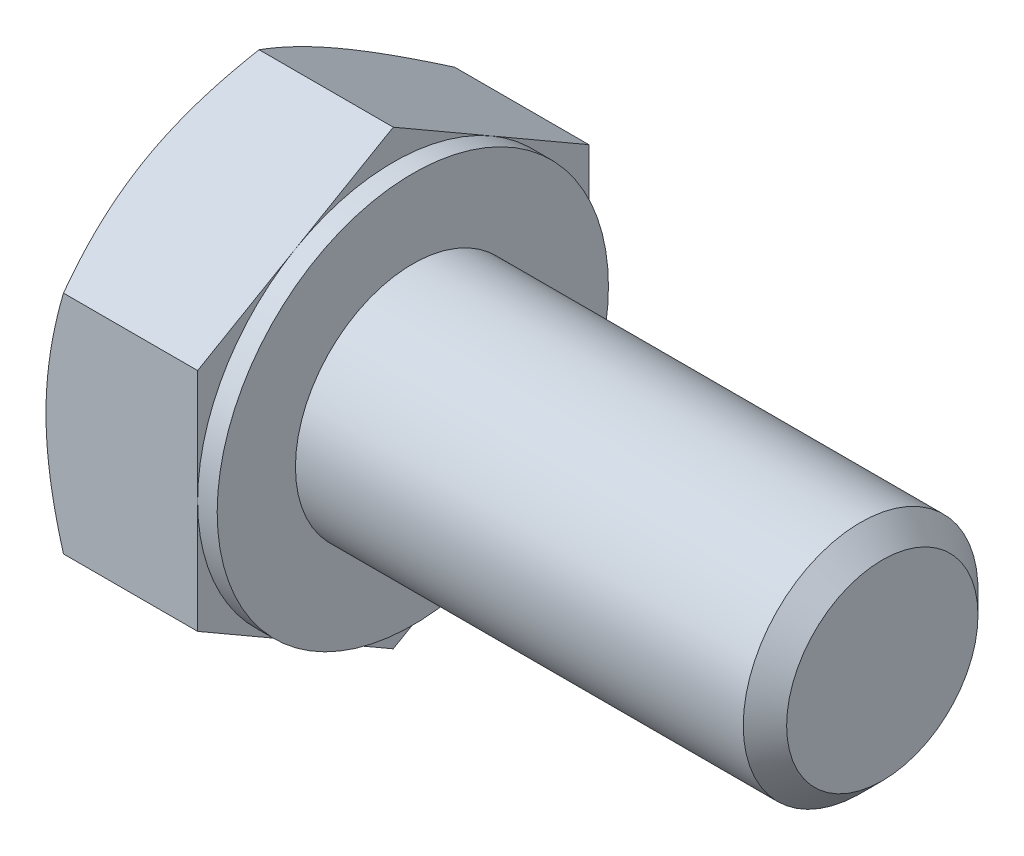
ISO-10303-21;
HEADER;
FILE_DESCRIPTION(('STEP AP214'),'2;1');
FILE_NAME('part.step','',(''),(''),'','','');
FILE_SCHEMA(('AUTOMOTIVE_DESIGN { 1 0 10303 214 1 1 1 1 }'));
ENDSEC;
DATA;
#1=APPLICATION_CONTEXT('core data for automotive mechanical design processes');
#2=APPLICATION_PROTOCOL_DEFINITION('international standard','automotive_design',2000,#1);
#3=PRODUCT_CONTEXT('',#1,'mechanical');
#4=PRODUCT('Part','Part','',(#3));
#5=PRODUCT_RELATED_PRODUCT_CATEGORY('part','',(#4));
#6=PRODUCT_DEFINITION_FORMATION('','',#4);
#7=PRODUCT_DEFINITION_CONTEXT('part definition',#1,'design');
#8=PRODUCT_DEFINITION('design','',#6,#7);
#9=PRODUCT_DEFINITION_SHAPE('','',#8);
#10=(LENGTH_UNIT() NAMED_UNIT(*) SI_UNIT(.MILLI.,.METRE.));
#11=(NAMED_UNIT(*) PLANE_ANGLE_UNIT() SI_UNIT($,.RADIAN.));
#12=(NAMED_UNIT(*) SI_UNIT($,.STERADIAN.) SOLID_ANGLE_UNIT());
#13=UNCERTAINTY_MEASURE_WITH_UNIT(LENGTH_MEASURE(1.E-05),#10,'distance_accuracy_value','');
#14=(GEOMETRIC_REPRESENTATION_CONTEXT(3) GLOBAL_UNCERTAINTY_ASSIGNED_CONTEXT((#13)) GLOBAL_UNIT_ASSIGNED_CONTEXT((#10,
#11,#12)) REPRESENTATION_CONTEXT('',''));
#15=CARTESIAN_POINT('',(0.,0.,0.));
#16=DIRECTION('',(0.,0.,1.));
#17=DIRECTION('',(1.,0.,0.));
#18=AXIS2_PLACEMENT_3D('',#15,#16,#17);
#19=CARTESIAN_POINT('',(4.375,5.77350269189626,0.));
#20=DIRECTION('',(1.,0.,0.));
#21=DIRECTION('',(0.,0.,-1.));
#22=AXIS2_PLACEMENT_3D('',#19,#20,#21);
#23=PLANE('',#22);
#24=CARTESIAN_POINT('',(4.375,0.,0.));
#25=DIRECTION('',(1.,0.,0.));
#26=DIRECTION('',(0.,0.,-1.));
#27=AXIS2_PLACEMENT_3D('',#24,#25,#26);
#28=CIRCLE('',#27,3.);
#29=CARTESIAN_POINT('',(4.375,0.,-3.));
#30=VERTEX_POINT('',#29);
#31=EDGE_CURVE('E287',#30,#30,#28,.F.);
#32=ORIENTED_EDGE('',*,*,#31,.T.);
#33=EDGE_LOOP('',(#32));
#34=FACE_BOUND('',#33,.T.);
#35=CARTESIAN_POINT('',(4.375,0.,0.));
#36=DIRECTION('',(1.,0.,0.));
#37=DIRECTION('',(0.,0.,-1.));
#38=AXIS2_PLACEMENT_3D('',#35,#36,#37);
#39=CIRCLE('',#38,5.);
#40=CARTESIAN_POINT('',(4.375,0.,-5.));
#41=VERTEX_POINT('',#40);
#42=EDGE_CURVE('E306',#41,#41,#39,.T.);
#43=ORIENTED_EDGE('',*,*,#42,.T.);
#44=EDGE_LOOP('',(#43));
#45=FACE_BOUND('',#44,.T.);
#46=ADVANCED_FACE('F41',(#34,#45),#23,.T.);
#47=CARTESIAN_POINT('',(0.,0.,0.));
#48=DIRECTION('',(-1.,0.,0.));
#49=DIRECTION('',(0.,0.,1.));
#50=AXIS2_PLACEMENT_3D('',#47,#48,#49);
#51=CYLINDRICAL_SURFACE('',#50,3.);
#52=ORIENTED_EDGE('',*,*,#31,.F.);
#53=EDGE_LOOP('',(#52));
#54=FACE_BOUND('',#53,.T.);
#55=CARTESIAN_POINT('',(15.8205,0.,0.));
#56=DIRECTION('',(-1.,0.,0.));
#57=DIRECTION('',(0.,0.,1.));
#58=AXIS2_PLACEMENT_3D('',#55,#56,#57);
#59=CIRCLE('',#58,3.);
#60=CARTESIAN_POINT('',(15.8205,0.,3.));
#61=VERTEX_POINT('',#60);
#62=EDGE_CURVE('E284',#61,#61,#59,.T.);
#63=ORIENTED_EDGE('',*,*,#62,.T.);
#64=EDGE_LOOP('',(#63));
#65=FACE_BOUND('',#64,.T.);
#66=ADVANCED_FACE('F256',(#54,#65),#51,.T.);
#67=CARTESIAN_POINT('',(16.375,0.,0.));
#68=DIRECTION('',(-1.,0.,0.));
#69=DIRECTION('',(0.,0.,1.));
#70=AXIS2_PLACEMENT_3D('',#67,#68,#69);
#71=CONICAL_SURFACE('',#70,2.4455,0.785398163397442);
#72=ORIENTED_EDGE('',*,*,#62,.F.);
#73=EDGE_LOOP('',(#72));
#74=FACE_BOUND('',#73,.T.);
#75=CARTESIAN_POINT('',(16.375,0.,0.));
#76=DIRECTION('',(-1.,0.,0.));
#77=DIRECTION('',(0.,0.,1.));
#78=AXIS2_PLACEMENT_3D('',#75,#76,#77);
#79=CIRCLE('',#78,2.4455);
#80=CARTESIAN_POINT('',(16.375,0.,2.4455));
#81=VERTEX_POINT('',#80);
#82=EDGE_CURVE('E282',#81,#81,#79,.T.);
#83=ORIENTED_EDGE('',*,*,#82,.T.);
#84=EDGE_LOOP('',(#83));
#85=FACE_BOUND('',#84,.T.);
#86=ADVANCED_FACE('F263',(#74,#85),#71,.T.);
#87=CARTESIAN_POINT('',(16.375,0.,0.));
#88=DIRECTION('',(-1.,0.,0.));
#89=DIRECTION('',(0.,0.,1.));
#90=AXIS2_PLACEMENT_3D('',#87,#88,#89);
#91=PLANE('',#90);
#92=ORIENTED_EDGE('',*,*,#82,.F.);
#93=EDGE_LOOP('',(#92));
#94=FACE_BOUND('',#93,.T.);
#95=ADVANCED_FACE('F270',(#94),#91,.F.);
#96=CARTESIAN_POINT('',(3.875,5.,0.));
#97=DIRECTION('',(1.,0.,0.));
#98=DIRECTION('',(0.,0.,-1.));
#99=AXIS2_PLACEMENT_3D('',#96,#97,#98);
#100=PLANE('',#99);
#101=DIRECTION('',(0.,0.500000000000001,0.866025403784438));
#102=VECTOR('',#101,1.);
#103=CARTESIAN_POINT('',(3.875,2.88675134594812,-5.));
#104=LINE('',#103,#102);
#105=CARTESIAN_POINT('',(3.875,2.88675134594812,-5.));
#106=VERTEX_POINT('',#105);
#107=CARTESIAN_POINT('',(3.875,4.33012701892219,-2.50000000000001));
#108=VERTEX_POINT('',#107);
#109=EDGE_CURVE('E174',#106,#108,#104,.T.);
#110=ORIENTED_EDGE('',*,*,#109,.T.);
#111=CARTESIAN_POINT('',(3.875,0.,0.));
#112=DIRECTION('',(-1.,0.,0.));
#113=DIRECTION('',(0.,0.,1.));
#114=AXIS2_PLACEMENT_3D('',#111,#112,#113);
#115=CIRCLE('',#114,5.);
#116=CARTESIAN_POINT('',(3.875,0.,-5.));
#117=VERTEX_POINT('',#116);
#118=EDGE_CURVE('E57',#108,#117,#115,.T.);
#119=ORIENTED_EDGE('',*,*,#118,.T.);
#120=DIRECTION('',(0.,1.,0.));
#121=VECTOR('',#120,1.);
#122=CARTESIAN_POINT('',(3.875,2.88675134594812,-5.));
#123=LINE('',#122,#121);
#124=EDGE_CURVE('E46',#117,#106,#123,.T.);
#125=ORIENTED_EDGE('',*,*,#124,.T.);
#126=EDGE_LOOP('',(#110,#119,#125));
#127=FACE_BOUND('',#126,.T.);
#128=ADVANCED_FACE('F273',(#127),#100,.T.);
#129=CARTESIAN_POINT('',(3.875,5.77350269189626,0.));
#130=VERTEX_POINT('',#129);
#131=EDGE_CURVE('E172',#108,#130,#104,.T.);
#132=ORIENTED_EDGE('',*,*,#131,.T.);
#133=DIRECTION('',(0.,-0.500000000000001,0.866025403784438));
#134=VECTOR('',#133,1.);
#135=CARTESIAN_POINT('',(3.875,5.77350269189626,0.));
#136=LINE('',#135,#134);
#137=CARTESIAN_POINT('',(3.875,4.33012701892219,2.50000000000001));
#138=VERTEX_POINT('',#137);
#139=EDGE_CURVE('E171',#130,#138,#136,.T.);
#140=ORIENTED_EDGE('',*,*,#139,.T.);
#141=EDGE_CURVE('E160',#138,#108,#115,.T.);
#142=ORIENTED_EDGE('',*,*,#141,.T.);
#143=EDGE_LOOP('',(#132,#140,#142));
#144=FACE_BOUND('',#143,.T.);
#145=ADVANCED_FACE('F278',(#144),#100,.T.);
#146=CARTESIAN_POINT('',(3.875,2.88675134594813,5.));
#147=VERTEX_POINT('',#146);
#148=EDGE_CURVE('E139',#138,#147,#136,.T.);
#149=ORIENTED_EDGE('',*,*,#148,.T.);
#150=DIRECTION('',(0.,-1.,0.));
#151=VECTOR('',#150,1.);
#152=CARTESIAN_POINT('',(3.875,2.88675134594813,5.));
#153=LINE('',#152,#151);
#154=CARTESIAN_POINT('',(3.875,0.,5.));
#155=VERTEX_POINT('',#154);
#156=EDGE_CURVE('E133',#147,#155,#153,.T.);
#157=ORIENTED_EDGE('',*,*,#156,.T.);
#158=EDGE_CURVE('E137',#155,#138,#115,.T.);
#159=ORIENTED_EDGE('',*,*,#158,.T.);
#160=EDGE_LOOP('',(#149,#157,#159));
#161=FACE_BOUND('',#160,.T.);
#162=ADVANCED_FACE('F135',(#161),#100,.T.);
#163=CARTESIAN_POINT('',(3.875,-2.88675134594813,5.));
#164=VERTEX_POINT('',#163);
#165=EDGE_CURVE('E143',#155,#164,#153,.T.);
#166=ORIENTED_EDGE('',*,*,#165,.T.);
#167=DIRECTION('',(0.,-0.500000000000001,-0.866025403784438));
#168=VECTOR('',#167,1.);
#169=CARTESIAN_POINT('',(3.875,-5.77350269189627,0.));
#170=LINE('',#169,#168);
#171=CARTESIAN_POINT('',(3.875,-4.33012701892219,2.50000000000001));
#172=VERTEX_POINT('',#171);
#173=EDGE_CURVE('E150',#164,#172,#170,.T.);
#174=ORIENTED_EDGE('',*,*,#173,.T.);
#175=EDGE_CURVE('E147',#172,#155,#115,.T.);
#176=ORIENTED_EDGE('',*,*,#175,.T.);
#177=EDGE_LOOP('',(#166,#174,#176));
#178=FACE_BOUND('',#177,.T.);
#179=ADVANCED_FACE('F148',(#178),#100,.T.);
#180=CARTESIAN_POINT('',(3.875,-5.77350269189627,0.));
#181=VERTEX_POINT('',#180);
#182=EDGE_CURVE('E166',#172,#181,#170,.T.);
#183=ORIENTED_EDGE('',*,*,#182,.T.);
#184=DIRECTION('',(0.,0.500000000000001,-0.866025403784438));
#185=VECTOR('',#184,1.);
#186=CARTESIAN_POINT('',(3.875,-2.88675134594814,-5.));
#187=LINE('',#186,#185);
#188=CARTESIAN_POINT('',(3.875,-4.33012701892219,-2.5));
#189=VERTEX_POINT('',#188);
#190=EDGE_CURVE('E342',#181,#189,#187,.T.);
#191=ORIENTED_EDGE('',*,*,#190,.T.);
#192=EDGE_CURVE('E154',#189,#172,#115,.T.);
#193=ORIENTED_EDGE('',*,*,#192,.T.);
#194=EDGE_LOOP('',(#183,#191,#193));
#195=FACE_BOUND('',#194,.T.);
#196=ADVANCED_FACE('F347',(#195),#100,.T.);
#197=CARTESIAN_POINT('',(3.875,-2.88675134594814,-5.));
#198=VERTEX_POINT('',#197);
#199=EDGE_CURVE('E161',#189,#198,#187,.T.);
#200=ORIENTED_EDGE('',*,*,#199,.T.);
#201=EDGE_CURVE('E11',#198,#117,#123,.T.);
#202=ORIENTED_EDGE('',*,*,#201,.T.);
#203=EDGE_CURVE('E360',#117,#189,#115,.T.);
#204=ORIENTED_EDGE('',*,*,#203,.T.);
#205=EDGE_LOOP('',(#200,#202,#204));
#206=FACE_BOUND('',#205,.T.);
#207=ADVANCED_FACE('F279',(#206),#100,.T.);
#208=CARTESIAN_POINT('',(0.,0.,0.));
#209=DIRECTION('',(-1.,0.,0.));
#210=DIRECTION('',(0.,0.,1.));
#211=AXIS2_PLACEMENT_3D('',#208,#209,#210);
#212=CYLINDRICAL_SURFACE('',#211,5.);
#213=ORIENTED_EDGE('',*,*,#118,.F.);
#214=ORIENTED_EDGE('',*,*,#141,.F.);
#215=ORIENTED_EDGE('',*,*,#158,.F.);
#216=ORIENTED_EDGE('',*,*,#175,.F.);
#217=ORIENTED_EDGE('',*,*,#192,.F.);
#218=ORIENTED_EDGE('',*,*,#203,.F.);
#219=EDGE_LOOP('',(#213,#214,#215,#216,#217,#218));
#220=FACE_BOUND('',#219,.T.);
#221=ORIENTED_EDGE('',*,*,#42,.F.);
#222=EDGE_LOOP('',(#221));
#223=FACE_BOUND('',#222,.T.);
#224=ADVANCED_FACE('F157',(#220,#223),#212,.T.);
#225=CARTESIAN_POINT('',(0.,5.77350269189626,0.));
#226=DIRECTION('',(1.,0.,0.));
#227=DIRECTION('',(0.,0.,-1.));
#228=AXIS2_PLACEMENT_3D('',#225,#226,#227);
#229=PLANE('',#228);
#230=CARTESIAN_POINT('',(0.,0.,0.));
#231=DIRECTION('',(1.,0.,0.));
#232=DIRECTION('',(0.,0.,-1.));
#233=AXIS2_PLACEMENT_3D('',#230,#231,#232);
#234=CIRCLE('',#233,5.);
#235=CARTESIAN_POINT('',(0.,0.,-5.));
#236=VERTEX_POINT('',#235);
#237=CARTESIAN_POINT('',(0.,4.33012701892219,-2.50000000000001));
#238=VERTEX_POINT('',#237);
#239=EDGE_CURVE('E305',#236,#238,#234,.T.);
#240=ORIENTED_EDGE('',*,*,#239,.F.);
#241=CARTESIAN_POINT('',(0.,-4.33012701892219,-2.5));
#242=VERTEX_POINT('',#241);
#243=EDGE_CURVE('E302',#242,#236,#234,.T.);
#244=ORIENTED_EDGE('',*,*,#243,.F.);
#245=CARTESIAN_POINT('',(0.,-4.33012701892219,2.50000000000001));
#246=VERTEX_POINT('',#245);
#247=EDGE_CURVE('E304',#246,#242,#234,.T.);
#248=ORIENTED_EDGE('',*,*,#247,.F.);
#249=CARTESIAN_POINT('',(0.,0.,5.));
#250=VERTEX_POINT('',#249);
#251=EDGE_CURVE('E314',#250,#246,#234,.T.);
#252=ORIENTED_EDGE('',*,*,#251,.F.);
#253=CARTESIAN_POINT('',(0.,0.,0.));
#254=DIRECTION('',(-1.,0.,0.));
#255=DIRECTION('',(0.,0.,1.));
#256=AXIS2_PLACEMENT_3D('',#253,#254,#255);
#257=CIRCLE('',#256,5.);
#258=CARTESIAN_POINT('',(0.,4.33012701892219,2.50000000000001));
#259=VERTEX_POINT('',#258);
#260=EDGE_CURVE('E175',#250,#259,#257,.T.);
#261=ORIENTED_EDGE('',*,*,#260,.T.);
#262=EDGE_CURVE('E309',#238,#259,#234,.T.);
#263=ORIENTED_EDGE('',*,*,#262,.F.);
#264=EDGE_LOOP('',(#240,#244,#248,#252,#261,#263));
#265=FACE_BOUND('',#264,.T.);
#266=ADVANCED_FACE('F206',(#265),#229,.F.);
#267=CARTESIAN_POINT('',(0.,0.,0.));
#268=DIRECTION('',(1.,0.,0.));
#269=DIRECTION('',(0.,0.,-1.));
#270=AXIS2_PLACEMENT_3D('',#267,#268,#269);
#271=CONICAL_SURFACE('',#270,5.,1.0471975511966);
#272=CARTESIAN_POINT('',(0.446648656051827,2.88663587589429,5.0002));
#273=CARTESIAN_POINT('',(0.373386567637633,3.01349970319368,4.78046540547481));
#274=CARTESIAN_POINT('',(0.30675132191809,3.14144859993849,4.55885141554042));
#275=CARTESIAN_POINT('',(0.19043899101081,3.39956193532121,4.11178600454649));
#276=CARTESIAN_POINT('',(0.140803049915788,3.52973095989717,3.88632664040923));
#277=CARTESIAN_POINT('',(0.0635510254186973,3.78847564779797,3.43816769477649));
#278=CARTESIAN_POINT('',(0.035420378283489,3.91701101576052,3.21553790689581));
#279=CARTESIAN_POINT('',(0.0101949219536844,4.11026620624322,2.88081009815336));
#280=CARTESIAN_POINT('',(0.00461345976948404,4.17472868879311,2.76915780319494));
#281=CARTESIAN_POINT('',(-0.000797783248529712,4.30371322717528,2.5457500293262));
#282=CARTESIAN_POINT('',(-0.00062774174179669,4.36823528110589,2.43399455370969));
#283=CARTESIAN_POINT('',(0.00775363179203661,4.54500768479194,2.12781576914936));
#284=CARTESIAN_POINT('',(0.0218297718972524,4.65719946015293,1.93349391403279));
#285=CARTESIAN_POINT('',(0.0664652571094322,4.88083840557981,1.54613989800229));
#286=CARTESIAN_POINT('',(0.0970398601475092,4.9922847895602,1.35310909862843));
#287=CARTESIAN_POINT('',(0.173468493621165,5.21637431361295,0.964974657525145));
#288=CARTESIAN_POINT('',(0.219646378878681,5.32898917185759,0.769920001358264));
#289=CARTESIAN_POINT('',(0.324451794491936,5.55253939626498,0.382719654641231));
#290=CARTESIAN_POINT('',(0.383054703437376,5.66347762579592,0.190569004591913));
#291=CARTESIAN_POINT('',(0.446648656051831,5.7736181619501,-0.000200000000000752));
#292=B_SPLINE_CURVE_WITH_KNOTS('',3,(#272,#273,#274,#275,#276,#277,#278,#279,#280,#281,#282,
#283,#284,#285,#286,#287,#288,#289,#290,#291),.UNSPECIFIED.,.F.,.F.,(4,2,2,2,2,2,2,2,2,4),(0.,
0.792555841363091,1.58701660053333,2.3618153748728,2.74884076077325,3.13585419177295,
3.80962362599679,4.48401723901189,5.17336882348929,5.86136694793726),.UNSPECIFIED.);
#293=CARTESIAN_POINT('',(0.446581987385204,5.77350269189626,0.));
#294=VERTEX_POINT('',#293);
#295=EDGE_CURVE('E225',#259,#294,#292,.T.);
#296=ORIENTED_EDGE('',*,*,#295,.T.);
#297=CARTESIAN_POINT('',(0.44664865605183,5.7736181619501,0.0002));
#298=CARTESIAN_POINT('',(0.373386567637636,5.64675433465071,-0.219534594525185));
#299=CARTESIAN_POINT('',(0.306751321918093,5.5188054379059,-0.44114858445958));
#300=CARTESIAN_POINT('',(0.190438991010812,5.26069210252318,-0.888213995453513));
#301=CARTESIAN_POINT('',(0.14080304991579,5.13052307794721,-1.11367335959077));
#302=CARTESIAN_POINT('',(0.0635510254186989,4.87177839004641,-1.56183230522351));
#303=CARTESIAN_POINT('',(0.0354203782834904,4.74324302208387,-1.78446209310419));
#304=CARTESIAN_POINT('',(0.0101949219536849,4.54998783160116,-2.11918990184664));
#305=CARTESIAN_POINT('',(0.00461345976948399,4.48552534905128,-2.23084219680506));
#306=CARTESIAN_POINT('',(-0.00079778324852991,4.35654081066911,-2.4542499706738));
#307=CARTESIAN_POINT('',(-0.000627741741796554,4.2920187567385,-2.56600544629031));
#308=CARTESIAN_POINT('',(0.00775363179203672,4.11524635305244,-2.87218423085064));
#309=CARTESIAN_POINT('',(0.0218297718972514,4.00305457769146,-3.06650608596721));
#310=CARTESIAN_POINT('',(0.0664652571094302,3.77941563226457,-3.4538601019977));
#311=CARTESIAN_POINT('',(0.0970398601475074,3.66796924828418,-3.64689090137157));
#312=CARTESIAN_POINT('',(0.173468493621163,3.44387972423144,-4.03502534247485));
#313=CARTESIAN_POINT('',(0.219646378878679,3.3312648659868,-4.23007999864173));
#314=CARTESIAN_POINT('',(0.324451794491932,3.1077146415794,-4.61728034535877));
#315=CARTESIAN_POINT('',(0.383054703437372,2.99677641204847,-4.80943099540809));
#316=CARTESIAN_POINT('',(0.446648656051827,2.88663587589429,-5.0002));
#317=B_SPLINE_CURVE_WITH_KNOTS('',3,(#297,#298,#299,#300,#301,#302,#303,#304,#305,#306,#307,
#308,#309,#310,#311,#312,#313,#314,#315,#316),.UNSPECIFIED.,.F.,.F.,(4,2,2,2,2,2,2,2,2,4),(0.,
0.79255584136309,1.58701660053334,2.36181537487281,2.74884076077326,3.13585419177295,
3.80962362599679,4.48401723901189,5.17336882348929,5.86136694793726),.UNSPECIFIED.);
#318=EDGE_CURVE('E65',#294,#238,#317,.T.);
#319=ORIENTED_EDGE('',*,*,#318,.T.);
#320=ORIENTED_EDGE('',*,*,#262,.T.);
#321=EDGE_LOOP('',(#296,#319,#320));
#322=FACE_BOUND('',#321,.T.);
#323=ADVANCED_FACE('F356',(#322),#271,.T.);
#324=CARTESIAN_POINT('',(2.47533544689296,-7.82661640313891,5.));
#325=CARTESIAN_POINT('',(2.36879683507773,-7.60758613024923,5.));
#326=CARTESIAN_POINT('',(2.26325911833056,-7.38806071364412,5.));
#327=CARTESIAN_POINT('',(2.05474707865951,-6.94775649535434,5.));
#328=CARTESIAN_POINT('',(1.95177314617003,-6.72697750897689,5.));
#329=CARTESIAN_POINT('',(1.74844778545275,-6.28280027125598,5.));
#330=CARTESIAN_POINT('',(1.64811306490869,-6.05939434592714,5.));
#331=CARTESIAN_POINT('',(1.45145486004312,-5.61083043832921,5.));
#332=CARTESIAN_POINT('',(1.35513119080617,-5.38567253739806,5.));
#333=CARTESIAN_POINT('',(1.16445037605961,-4.92576614780204,5.));
#334=CARTESIAN_POINT('',(1.07026351405996,-4.69094667859486,5.));
#335=CARTESIAN_POINT('',(0.88884438735084,-4.21858752735363,5.));
#336=CARTESIAN_POINT('',(0.801612892640662,-3.98104754746318,5.));
#337=CARTESIAN_POINT('',(0.636341071883242,-3.50329086404364,5.));
#338=CARTESIAN_POINT('',(0.558282765149713,-3.26308044250488,5.));
#339=CARTESIAN_POINT('',(0.413813856737667,-2.77921467819532,5.));
#340=CARTESIAN_POINT('',(0.347399663631977,-2.53556042276,5.));
#341=CARTESIAN_POINT('',(0.229707450535053,-2.04600448312504,5.));
#342=CARTESIAN_POINT('',(0.17834657344248,-1.80012308686184,5.));
#343=CARTESIAN_POINT('',(0.0936230804935156,-1.30522837494366,5.));
#344=CARTESIAN_POINT('',(0.0602585789244929,-1.05621539022478,5.));
#345=CARTESIAN_POINT('',(0.0146229933804848,-0.559584253783076,5.));
#346=CARTESIAN_POINT('',(0.0020749850658413,-0.311992192967683,5.));
#347=CARTESIAN_POINT('',(-0.00159747165030544,0.18337558405673,5.));
#348=CARTESIAN_POINT('',(0.00727849448086171,0.431151303726633,5.));
#349=CARTESIAN_POINT('',(0.0397265053205832,0.849622860758219,5.));
#350=CARTESIAN_POINT('',(0.0579847912618786,1.02075746544155,5.));
#351=CARTESIAN_POINT('',(0.103624049996721,1.36181398757519,5.));
#352=CARTESIAN_POINT('',(0.131006199082923,1.5317357457727,5.));
#353=CARTESIAN_POINT('',(0.22540333381632,2.03942834541586,5.));
#354=CARTESIAN_POINT('',(0.304653621104034,2.37495177168562,5.));
#355=CARTESIAN_POINT('',(0.442611792168637,2.87686006020151,5.));
#356=CARTESIAN_POINT('',(0.492453035928114,3.04583048582564,5.));
#357=CARTESIAN_POINT('',(0.597441969480138,3.38213061038658,5.));
#358=CARTESIAN_POINT('',(0.652589698776803,3.54946029709868,5.));
#359=CARTESIAN_POINT('',(0.767295730006394,3.88253122341816,5.));
#360=CARTESIAN_POINT('',(0.826852713137812,4.04827292137364,5.));
#361=CARTESIAN_POINT('',(0.949663499110048,4.37837269604182,5.));
#362=CARTESIAN_POINT('',(1.01291722636637,4.54273080096525,5.));
#363=CARTESIAN_POINT('',(1.18384085306905,4.97467594039768,5.));
#364=CARTESIAN_POINT('',(1.29410564783453,5.24123504256647,5.));
#365=CARTESIAN_POINT('',(1.52085041203992,5.77170603526333,5.));
#366=CARTESIAN_POINT('',(1.63733099805396,6.03561766007927,5.));
#367=CARTESIAN_POINT('',(1.87507624393348,6.56138078778337,5.));
#368=CARTESIAN_POINT('',(1.99634255328237,6.82323154239328,5.));
#369=CARTESIAN_POINT('',(2.24254703861692,7.34518395602015,5.));
#370=CARTESIAN_POINT('',(2.36748508200601,7.60528567778374,5.));
#371=CARTESIAN_POINT('',(2.62044102887897,8.12446478659921,5.));
#372=CARTESIAN_POINT('',(2.74846325062125,8.38354006552432,5.));
#373=CARTESIAN_POINT('',(3.00682668967549,8.9005329112754,5.));
#374=CARTESIAN_POINT('',(3.13716793074432,9.15845046620728,5.));
#375=CARTESIAN_POINT('',(3.53092424591316,9.93067662274979,5.));
#376=CARTESIAN_POINT('',(3.79712405172275,10.4435647238032,5.));
#377=CARTESIAN_POINT('',(4.3072404688117,11.4147548711532,5.));
#378=CARTESIAN_POINT('',(4.55067498762245,11.873311348306,5.));
#379=CARTESIAN_POINT('',(5.04052915785298,12.7888590468283,5.));
#380=CARTESIAN_POINT('',(5.28694897482743,13.2458501795696,5.));
#381=CARTESIAN_POINT('',(5.7812250534644,14.1571829390174,5.));
#382=CARTESIAN_POINT('',(6.02907430461245,14.6115283739736,5.));
#383=CARTESIAN_POINT('',(6.52648185519851,15.5192398746589,5.));
#384=CARTESIAN_POINT('',(6.77604002809907,15.9726060096992,5.));
#385=CARTESIAN_POINT('',(7.02622264559118,16.4256251044156,5.));
#386=B_SPLINE_CURVE_WITH_KNOTS('',3,(#324,#325,#326,#327,#328,#329,#330,#331,#332,#333,#334,
#335,#336,#337,#338,#339,#340,#341,#342,#343,#344,#345,#346,#347,#348,#349,#350,#351,#352,#353,
#354,#355,#356,#357,#358,#359,#360,#361,#362,#363,#364,#365,#366,#367,#368,#369,#370,#371,#372,
#373,#374,#375,#376,#377,#378,#379,#380,#381,#382,#383,#384,#385),.UNSPECIFIED.,.F.,.F.,(4,2,2,
2,2,2,2,2,2,2,2,2,2,2,2,2,2,2,2,2,2,2,2,2,2,2,2,2,2,2,4),(0.,0.730708682143099,1.46152797033751,
2.19620403652929,2.930846195478,3.68977491658213,4.44878753915767,5.20628666210828,
5.9635517348485,6.71656679485872,7.46950293642268,8.212339912373,8.95519126159774,
9.4712599123247,9.98739512288343,11.0201893937443,11.5486465414698,12.0771076235976,
12.6054112774226,13.1337041332035,13.9989833719716,14.8643486020619,15.7300147459346,
16.5956496665091,17.4625765068272,18.3295122333794,20.0630293163822,21.6205191219182,
23.1780956996636,24.7307447704824,26.2832800921359),.UNSPECIFIED.);
#387=CARTESIAN_POINT('',(0.446581987385201,2.88675134594812,5.));
#388=VERTEX_POINT('',#387);
#389=EDGE_CURVE('E239',#250,#388,#386,.T.);
#390=ORIENTED_EDGE('',*,*,#389,.T.);
#391=EDGE_CURVE('E238',#388,#259,#292,.T.);
#392=ORIENTED_EDGE('',*,*,#391,.T.);
#393=ORIENTED_EDGE('',*,*,#260,.F.);
#394=EDGE_LOOP('',(#390,#392,#393));
#395=FACE_BOUND('',#394,.T.);
#396=ADVANCED_FACE('F352',(#395),#271,.T.);
#397=CARTESIAN_POINT('',(0.446581987385203,-2.88675134594813,5.));
#398=VERTEX_POINT('',#397);
#399=EDGE_CURVE('E285',#398,#250,#386,.T.);
#400=ORIENTED_EDGE('',*,*,#399,.T.);
#401=ORIENTED_EDGE('',*,*,#251,.T.);
#402=CARTESIAN_POINT('',(0.446648656051836,-5.77361816195011,-0.000200000000000037));
#403=CARTESIAN_POINT('',(0.373386567637641,-5.64675433465072,0.219534594525185));
#404=CARTESIAN_POINT('',(0.306751321918098,-5.51880543790591,0.441148584459581));
#405=CARTESIAN_POINT('',(0.190438991010817,-5.26069210252319,0.888213995453515));
#406=CARTESIAN_POINT('',(0.140803049915796,-5.13052307794722,1.11367335959078));
#407=CARTESIAN_POINT('',(0.0635510254187038,-4.87177839004642,1.56183230522351));
#408=CARTESIAN_POINT('',(0.0354203782834944,-4.74324302208388,1.7844620931042));
#409=CARTESIAN_POINT('',(0.0101949219536894,-4.54998783160117,2.11918990184664));
#410=CARTESIAN_POINT('',(0.00461345976948905,-4.48552534905129,2.23084219680506));
#411=CARTESIAN_POINT('',(-0.000797783248524703,-4.35654081066912,2.4542499706738));
#412=CARTESIAN_POINT('',(-0.000627741741791686,-4.29201875673851,2.56600544629032));
#413=CARTESIAN_POINT('',(0.00775363179204125,-4.11524635305245,2.87218423085064));
#414=CARTESIAN_POINT('',(0.0218297718972562,-4.00305457769147,3.06650608596722));
#415=CARTESIAN_POINT('',(0.066465257109435,-3.77941563226458,3.45386010199771));
#416=CARTESIAN_POINT('',(0.0970398601475117,-3.66796924828419,3.64689090137157));
#417=CARTESIAN_POINT('',(0.173468493621166,-3.44387972423144,4.03502534247485));
#418=CARTESIAN_POINT('',(0.219646378878683,-3.33126486598681,4.23007999864174));
#419=CARTESIAN_POINT('',(0.324451794491936,-3.10771464157941,4.61728034535877));
#420=CARTESIAN_POINT('',(0.383054703437375,-2.99677641204848,4.80943099540809));
#421=CARTESIAN_POINT('',(0.446648656051829,-2.8866358758943,5.0002));
#422=B_SPLINE_CURVE_WITH_KNOTS('',3,(#402,#403,#404,#405,#406,#407,#408,#409,#410,#411,#412,
#413,#414,#415,#416,#417,#418,#419,#420,#421),.UNSPECIFIED.,.F.,.F.,(4,2,2,2,2,2,2,2,2,4),(0.,
0.792555841363093,1.58701660053334,2.36181537487281,2.74884076077326,3.13585419177296,
3.8096236259968,4.4840172390119,5.17336882348929,5.86136694793725),.UNSPECIFIED.);
#423=EDGE_CURVE('E227',#246,#398,#422,.T.);
#424=ORIENTED_EDGE('',*,*,#423,.T.);
#425=EDGE_LOOP('',(#400,#401,#424));
#426=FACE_BOUND('',#425,.T.);
#427=ADVANCED_FACE('F195',(#426),#271,.T.);
#428=CARTESIAN_POINT('',(0.446581987385209,-5.77350269189627,0.));
#429=VERTEX_POINT('',#428);
#430=EDGE_CURVE('E219',#429,#246,#422,.T.);
#431=ORIENTED_EDGE('',*,*,#430,.T.);
#432=ORIENTED_EDGE('',*,*,#247,.T.);
#433=CARTESIAN_POINT('',(0.446648656051831,-2.8866358758943,-5.0002));
#434=CARTESIAN_POINT('',(0.373386567637637,-3.01349970319369,-4.78046540547481));
#435=CARTESIAN_POINT('',(0.306751321918095,-3.1414485999385,-4.55885141554042));
#436=CARTESIAN_POINT('',(0.190438991010814,-3.39956193532122,-4.11178600454649));
#437=CARTESIAN_POINT('',(0.140803049915792,-3.52973095989719,-3.88632664040923));
#438=CARTESIAN_POINT('',(0.0635510254187018,-3.78847564779799,-3.43816769477649));
#439=CARTESIAN_POINT('',(0.0354203782834936,-3.91701101576053,-3.21553790689581));
#440=CARTESIAN_POINT('',(0.0101949219536891,-4.11026620624324,-2.88081009815336));
#441=CARTESIAN_POINT('',(0.00461345976948861,-4.17472868879312,-2.76915780319494));
#442=CARTESIAN_POINT('',(-0.00079778324852476,-4.30371322717529,-2.5457500293262));
#443=CARTESIAN_POINT('',(-0.000627741741791278,-4.3682352811059,-2.43399455370968));
#444=CARTESIAN_POINT('',(0.00775363179204262,-4.54500768479195,-2.12781576914936));
#445=CARTESIAN_POINT('',(0.021829771897258,-4.65719946015294,-1.93349391403278));
#446=CARTESIAN_POINT('',(0.0664652571094377,-4.88083840557983,-1.54613989800229));
#447=CARTESIAN_POINT('',(0.097039860147515,-4.99228478956021,-1.35310909862843));
#448=CARTESIAN_POINT('',(0.173468493621171,-5.21637431361296,-0.964974657525145));
#449=CARTESIAN_POINT('',(0.219646378878687,-5.3289891718576,-0.769920001358264));
#450=CARTESIAN_POINT('',(0.324451794491942,-5.55253939626499,-0.382719654641232));
#451=CARTESIAN_POINT('',(0.383054703437381,-5.66347762579593,-0.190569004591913));
#452=CARTESIAN_POINT('',(0.446648656051836,-5.77361816195011,0.000200000000000055));
#453=B_SPLINE_CURVE_WITH_KNOTS('',3,(#433,#434,#435,#436,#437,#438,#439,#440,#441,#442,#443,
#444,#445,#446,#447,#448,#449,#450,#451,#452),.UNSPECIFIED.,.F.,.F.,(4,2,2,2,2,2,2,2,2,4),(0.,
0.792555841363092,1.58701660053334,2.36181537487281,2.74884076077326,3.13585419177295,
3.8096236259968,4.4840172390119,5.17336882348929,5.86136694793726),.UNSPECIFIED.);
#454=EDGE_CURVE('E226',#242,#429,#453,.T.);
#455=ORIENTED_EDGE('',*,*,#454,.T.);
#456=EDGE_LOOP('',(#431,#432,#455));
#457=FACE_BOUND('',#456,.T.);
#458=ADVANCED_FACE('F323',(#457),#271,.T.);
#459=CARTESIAN_POINT('',(0.4465819873852,2.88675134594812,-5.));
#460=VERTEX_POINT('',#459);
#461=EDGE_CURVE('E228',#238,#460,#317,.T.);
#462=ORIENTED_EDGE('',*,*,#461,.T.);
#463=CARTESIAN_POINT('',(2.47533544773018,-7.82661640485967,-5.));
#464=CARTESIAN_POINT('',(2.36879683588001,-7.60758613191209,-5.));
#465=CARTESIAN_POINT('',(2.2632591190979,-7.38806071524904,-5.));
#466=CARTESIAN_POINT('',(2.05474707935716,-6.9477564968432,-5.));
#467=CARTESIAN_POINT('',(1.95177314683291,-6.72697751040763,-5.));
#468=CARTESIAN_POINT('',(1.74844778604609,-6.28280027256958,-5.));
#469=CARTESIAN_POINT('',(1.64811306546725,-6.05939434718173,-5.));
#470=CARTESIAN_POINT('',(1.4514548605327,-5.61083043946536,-5.));
#471=CARTESIAN_POINT('',(1.35513119126155,-5.38567253847479,-5.));
#472=CARTESIAN_POINT('',(1.16445037644562,-4.92576614875538,-5.));
#473=CARTESIAN_POINT('',(1.07026351441089,-4.69094667948419,-5.));
#474=CARTESIAN_POINT('',(0.888844387633474,-4.21858752811391,-5.));
#475=CARTESIAN_POINT('',(0.801612892890087,-3.98104754815841,-5.));
#476=CARTESIAN_POINT('',(0.636341072069425,-3.50329086460758,-5.));
#477=CARTESIAN_POINT('',(0.558282765305855,-3.26308044300257,-5.));
#478=CARTESIAN_POINT('',(0.41381385683863,-2.77921467855872,-5.));
#479=CARTESIAN_POINT('',(0.3473996637078,-2.53556042305535,-5.));
#480=CARTESIAN_POINT('',(0.229707450560149,-2.04600448324933,-5.));
#481=CARTESIAN_POINT('',(0.178346573443938,-1.80012308688265,-5.));
#482=CARTESIAN_POINT('',(0.0936230804633189,-1.305228374755,-5.));
#483=CARTESIAN_POINT('',(0.0602585788862661,-1.05621538993015,-5.));
#484=CARTESIAN_POINT('',(0.0146229933450855,-0.559584253278236,-5.));
#485=CARTESIAN_POINT('',(0.00207498504095138,-0.31199219235864,-5.));
#486=CARTESIAN_POINT('',(-0.00159747163599442,0.183375584872585,-5.));
#487=CARTESIAN_POINT('',(0.0072784945238692,0.431151304645095,-5.));
#488=CARTESIAN_POINT('',(0.0397265054214768,0.849622861805586,-5.));
#489=CARTESIAN_POINT('',(0.0579847913857283,1.02075746651638,-5.));
#490=CARTESIAN_POINT('',(0.103624050167705,1.3618139887037,-5.));
#491=CARTESIAN_POINT('',(0.131006199278084,1.53173574692744,-5.));
#492=CARTESIAN_POINT('',(0.225403334084524,2.03942834664787,-5.));
#493=CARTESIAN_POINT('',(0.304653621421581,2.37495177296712,-5.));
#494=CARTESIAN_POINT('',(0.442611792558998,2.87686006155704,-5.));
#495=CARTESIAN_POINT('',(0.492453036342915,3.04583048720638,-5.));
#496=CARTESIAN_POINT('',(0.597441969943075,3.38213061181744,-5.));
#497=CARTESIAN_POINT('',(0.652589699263437,3.54946029855447,-5.));
#498=CARTESIAN_POINT('',(0.767295730539577,3.88253122492361,-5.));
#499=CARTESIAN_POINT('',(0.826852713693845,4.04827292290382,-5.));
#500=CARTESIAN_POINT('',(0.949663499710993,4.37837269762149,-5.));
#501=CARTESIAN_POINT('',(1.01291722698937,4.54273080256966,-5.));
#502=CARTESIAN_POINT('',(1.18384085372923,4.97467594201675,-5.));
#503=CARTESIAN_POINT('',(1.29410564850765,5.24123504417613,-5.));
#504=CARTESIAN_POINT('',(1.5208504127353,5.77170603685536,-5.));
#505=CARTESIAN_POINT('',(1.63733099875865,6.03561766166309,-5.));
#506=CARTESIAN_POINT('',(1.87507624465413,6.56138078935161,-5.));
#507=CARTESIAN_POINT('',(1.99634255400966,6.82323154395418,-5.));
#508=CARTESIAN_POINT('',(2.24254703935561,7.34518395756714,-5.));
#509=CARTESIAN_POINT('',(2.36748508274945,7.60528567932417,-5.));
#510=CARTESIAN_POINT('',(2.62044102963033,8.12446478812675,-5.));
#511=CARTESIAN_POINT('',(2.74846325137577,8.38354006704552,-5.));
#512=CARTESIAN_POINT('',(3.00682669043527,8.9005329127844,-5.));
#513=CARTESIAN_POINT('',(3.1371679315062,9.15845046771043,-5.));
#514=CARTESIAN_POINT('',(3.53092424668021,9.93067662423604,-5.));
#515=CARTESIAN_POINT('',(3.79712405249168,10.443564725279,-5.));
#516=CARTESIAN_POINT('',(4.30724046958687,11.4147548726184,-5.));
#517=CARTESIAN_POINT('',(4.55067498840222,11.8733113497711,-5.));
#518=CARTESIAN_POINT('',(5.04052915864103,12.7888590482936,-5.));
#519=CARTESIAN_POINT('',(5.28694897561916,13.2458501810351,-5.));
#520=CARTESIAN_POINT('',(5.78122505426358,14.1571829404851,-5.));
#521=CARTESIAN_POINT('',(6.02907430541544,14.6115283754434,-5.));
#522=CARTESIAN_POINT('',(6.52648185600867,15.519239876133,-5.));
#523=CARTESIAN_POINT('',(6.77604002891261,15.9726060111756,-5.));
#524=CARTESIAN_POINT('',(7.02622264640795,16.4256251058943,-5.));
#525=B_SPLINE_CURVE_WITH_KNOTS('',3,(#463,#464,#465,#466,#467,#468,#469,#470,#471,#472,#473,
#474,#475,#476,#477,#478,#479,#480,#481,#482,#483,#484,#485,#486,#487,#488,#489,#490,#491,#492,
#493,#494,#495,#496,#497,#498,#499,#500,#501,#502,#503,#504,#505,#506,#507,#508,#509,#510,#511,
#512,#513,#514,#515,#516,#517,#518,#519,#520,#521,#522,#523,#524),.UNSPECIFIED.,.F.,.F.,(4,2,2,
2,2,2,2,2,2,2,2,2,2,2,2,2,2,2,2,2,2,2,2,2,2,2,2,2,2,2,4),(0.,0.730708682345173,1.46152797074168,
2.19620403713772,2.93084619629068,3.6897749176122,4.44878754040521,5.20628666357256,
5.96355173652936,6.7165667968573,7.46950293873851,8.21233991499825,8.95519126453256,
9.47125991534871,9.98739512599665,11.0201893970363,11.5486465448551,12.0771076270762,
12.6054112809942,13.1337041368682,13.9989833756252,14.8643486057043,15.7300147495654,
16.5956496701284,17.4625765104336,18.329512236973,20.0630293199505,21.6205191254926,
23.178095703244,24.7307447740735,26.2832800957379),.UNSPECIFIED.);
#526=EDGE_CURVE('E187',#460,#236,#525,.F.);
#527=ORIENTED_EDGE('',*,*,#526,.T.);
#528=ORIENTED_EDGE('',*,*,#239,.T.);
#529=EDGE_LOOP('',(#462,#527,#528));
#530=FACE_BOUND('',#529,.T.);
#531=ADVANCED_FACE('F337',(#530),#271,.T.);
#532=CARTESIAN_POINT('',(0.44658198738495,-2.88675134594852,-5.));
#533=VERTEX_POINT('',#532);
#534=EDGE_CURVE('E188',#533,#242,#453,.T.);
#535=ORIENTED_EDGE('',*,*,#534,.T.);
#536=ORIENTED_EDGE('',*,*,#243,.T.);
#537=EDGE_CURVE('E178',#236,#533,#525,.F.);
#538=ORIENTED_EDGE('',*,*,#537,.T.);
#539=EDGE_LOOP('',(#535,#536,#538));
#540=FACE_BOUND('',#539,.T.);
#541=ADVANCED_FACE('F204',(#540),#271,.T.);
#542=CARTESIAN_POINT('',(4.375,2.88675134594812,-5.));
#543=DIRECTION('',(0.,0.,1.));
#544=DIRECTION('',(0.,-1.,0.));
#545=AXIS2_PLACEMENT_3D('',#542,#543,#544);
#546=PLANE('',#545);
#547=ORIENTED_EDGE('',*,*,#201,.F.);
#548=DIRECTION('',(-1.,0.,0.));
#549=VECTOR('',#548,1.);
#550=CARTESIAN_POINT('',(4.375,-2.88675134594814,-5.));
#551=LINE('',#550,#549);
#552=EDGE_CURVE('E293',#198,#533,#551,.T.);
#553=ORIENTED_EDGE('',*,*,#552,.T.);
#554=ORIENTED_EDGE('',*,*,#537,.F.);
#555=ORIENTED_EDGE('',*,*,#526,.F.);
#556=DIRECTION('',(-1.,0.,0.));
#557=VECTOR('',#556,1.);
#558=CARTESIAN_POINT('',(4.375,2.88675134594812,-5.));
#559=LINE('',#558,#557);
#560=EDGE_CURVE('E291',#106,#460,#559,.T.);
#561=ORIENTED_EDGE('',*,*,#560,.F.);
#562=ORIENTED_EDGE('',*,*,#124,.F.);
#563=EDGE_LOOP('',(#547,#553,#554,#555,#561,#562));
#564=FACE_BOUND('',#563,.T.);
#565=ADVANCED_FACE('F199',(#564),#546,.F.);
#566=CARTESIAN_POINT('',(4.375,-2.88675134594814,-5.));
#567=DIRECTION('',(0.,0.866025403784438,0.500000000000001));
#568=DIRECTION('',(0.,-0.500000000000001,0.866025403784438));
#569=AXIS2_PLACEMENT_3D('',#566,#567,#568);
#570=PLANE('',#569);
#571=ORIENTED_EDGE('',*,*,#190,.F.);
#572=DIRECTION('',(-1.,0.,0.));
#573=VECTOR('',#572,1.);
#574=CARTESIAN_POINT('',(4.375,-5.77350269189627,0.));
#575=LINE('',#574,#573);
#576=EDGE_CURVE('E295',#181,#429,#575,.T.);
#577=ORIENTED_EDGE('',*,*,#576,.T.);
#578=ORIENTED_EDGE('',*,*,#454,.F.);
#579=ORIENTED_EDGE('',*,*,#534,.F.);
#580=ORIENTED_EDGE('',*,*,#552,.F.);
#581=ORIENTED_EDGE('',*,*,#199,.F.);
#582=EDGE_LOOP('',(#571,#577,#578,#579,#580,#581));
#583=FACE_BOUND('',#582,.T.);
#584=ADVANCED_FACE('F203',(#583),#570,.F.);
#585=CARTESIAN_POINT('',(4.375,-5.77350269189627,0.));
#586=DIRECTION('',(0.,0.866025403784438,-0.500000000000001));
#587=DIRECTION('',(0.,0.500000000000001,0.866025403784438));
#588=AXIS2_PLACEMENT_3D('',#585,#586,#587);
#589=PLANE('',#588);
#590=ORIENTED_EDGE('',*,*,#173,.F.);
#591=DIRECTION('',(-1.,0.,0.));
#592=VECTOR('',#591,1.);
#593=CARTESIAN_POINT('',(4.375,-2.88675134594813,5.));
#594=LINE('',#593,#592);
#595=EDGE_CURVE('E165',#164,#398,#594,.T.);
#596=ORIENTED_EDGE('',*,*,#595,.T.);
#597=ORIENTED_EDGE('',*,*,#423,.F.);
#598=ORIENTED_EDGE('',*,*,#430,.F.);
#599=ORIENTED_EDGE('',*,*,#576,.F.);
#600=ORIENTED_EDGE('',*,*,#182,.F.);
#601=EDGE_LOOP('',(#590,#596,#597,#598,#599,#600));
#602=FACE_BOUND('',#601,.T.);
#603=ADVANCED_FACE('F211',(#602),#589,.F.);
#604=CARTESIAN_POINT('',(4.375,2.88675134594813,5.));
#605=DIRECTION('',(0.,0.,-1.));
#606=DIRECTION('',(0.,1.,0.));
#607=AXIS2_PLACEMENT_3D('',#604,#605,#606);
#608=PLANE('',#607);
#609=ORIENTED_EDGE('',*,*,#156,.F.);
#610=DIRECTION('',(-1.,0.,0.));
#611=VECTOR('',#610,1.);
#612=CARTESIAN_POINT('',(4.375,2.88675134594813,5.));
#613=LINE('',#612,#611);
#614=EDGE_CURVE('E298',#147,#388,#613,.T.);
#615=ORIENTED_EDGE('',*,*,#614,.T.);
#616=ORIENTED_EDGE('',*,*,#389,.F.);
#617=ORIENTED_EDGE('',*,*,#399,.F.);
#618=ORIENTED_EDGE('',*,*,#595,.F.);
#619=ORIENTED_EDGE('',*,*,#165,.F.);
#620=EDGE_LOOP('',(#609,#615,#616,#617,#618,#619));
#621=FACE_BOUND('',#620,.T.);
#622=ADVANCED_FACE('F163',(#621),#608,.F.);
#623=CARTESIAN_POINT('',(4.375,5.77350269189626,0.));
#624=DIRECTION('',(0.,-0.866025403784438,-0.500000000000001));
#625=DIRECTION('',(0.,0.500000000000001,-0.866025403784438));
#626=AXIS2_PLACEMENT_3D('',#623,#624,#625);
#627=PLANE('',#626);
#628=ORIENTED_EDGE('',*,*,#139,.F.);
#629=DIRECTION('',(-1.,0.,0.));
#630=VECTOR('',#629,1.);
#631=CARTESIAN_POINT('',(4.375,5.77350269189626,0.));
#632=LINE('',#631,#630);
#633=EDGE_CURVE('E300',#130,#294,#632,.T.);
#634=ORIENTED_EDGE('',*,*,#633,.T.);
#635=ORIENTED_EDGE('',*,*,#295,.F.);
#636=ORIENTED_EDGE('',*,*,#391,.F.);
#637=ORIENTED_EDGE('',*,*,#614,.F.);
#638=ORIENTED_EDGE('',*,*,#148,.F.);
#639=EDGE_LOOP('',(#628,#634,#635,#636,#637,#638));
#640=FACE_BOUND('',#639,.T.);
#641=ADVANCED_FACE('F245',(#640),#627,.F.);
#642=CARTESIAN_POINT('',(4.375,2.88675134594812,-5.));
#643=DIRECTION('',(0.,-0.866025403784438,0.500000000000001));
#644=DIRECTION('',(0.,-0.500000000000001,-0.866025403784438));
#645=AXIS2_PLACEMENT_3D('',#642,#643,#644);
#646=PLANE('',#645);
#647=ORIENTED_EDGE('',*,*,#109,.F.);
#648=ORIENTED_EDGE('',*,*,#560,.T.);
#649=ORIENTED_EDGE('',*,*,#461,.F.);
#650=ORIENTED_EDGE('',*,*,#318,.F.);
#651=ORIENTED_EDGE('',*,*,#633,.F.);
#652=ORIENTED_EDGE('',*,*,#131,.F.);
#653=EDGE_LOOP('',(#647,#648,#649,#650,#651,#652));
#654=FACE_BOUND('',#653,.T.);
#655=ADVANCED_FACE('F43',(#654),#646,.F.);
#656=CLOSED_SHELL('',(#46,#66,#86,#95,#128,#145,#162,#179,#196,#207,#224,#266,#323,#396,#427,
#458,#531,#541,#565,#584,#603,#622,#641,#655));
#657=MANIFOLD_SOLID_BREP('B2',#656);
#658=ADVANCED_BREP_SHAPE_REPRESENTATION('',(#18,#657),#14);
#659=SHAPE_DEFINITION_REPRESENTATION(#9,#658);
ENDSEC;
END-ISO-10303-21;
